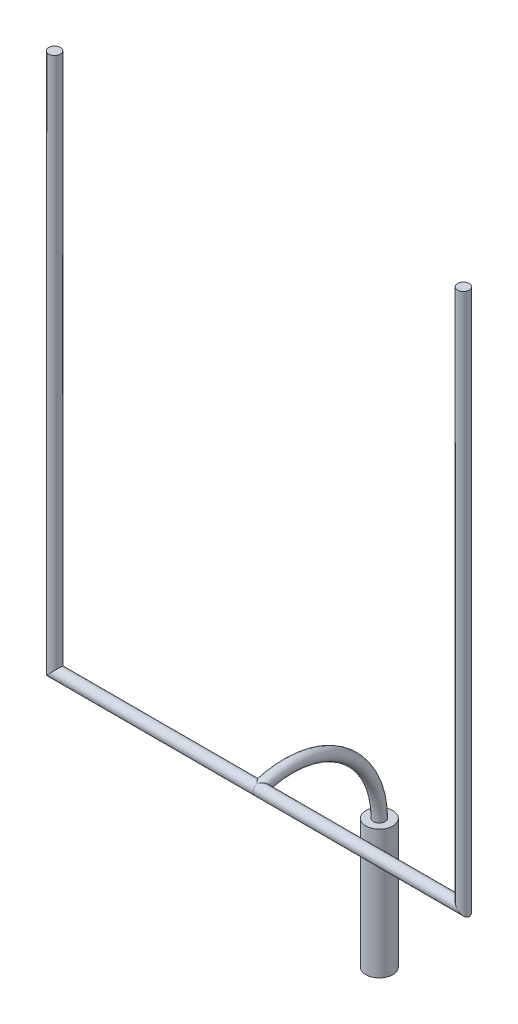
ISO-10303-21;
HEADER;
FILE_DESCRIPTION(('STEP AP214'),'2;1');
FILE_NAME('part.step','',(''),(''),'','','');
FILE_SCHEMA(('AUTOMOTIVE_DESIGN { 1 0 10303 214 1 1 1 1 }'));
ENDSEC;
DATA;
#1=APPLICATION_CONTEXT('core data for automotive mechanical design processes');
#2=APPLICATION_PROTOCOL_DEFINITION('international standard','automotive_design',2000,#1);
#3=PRODUCT_CONTEXT('',#1,'mechanical');
#4=PRODUCT('Part','Part','',(#3));
#5=PRODUCT_RELATED_PRODUCT_CATEGORY('part','',(#4));
#6=PRODUCT_DEFINITION_FORMATION('','',#4);
#7=PRODUCT_DEFINITION_CONTEXT('part definition',#1,'design');
#8=PRODUCT_DEFINITION('design','',#6,#7);
#9=PRODUCT_DEFINITION_SHAPE('','',#8);
#10=(LENGTH_UNIT() NAMED_UNIT(*) SI_UNIT(.MILLI.,.METRE.));
#11=(NAMED_UNIT(*) PLANE_ANGLE_UNIT() SI_UNIT($,.RADIAN.));
#12=(NAMED_UNIT(*) SI_UNIT($,.STERADIAN.) SOLID_ANGLE_UNIT());
#13=UNCERTAINTY_MEASURE_WITH_UNIT(LENGTH_MEASURE(1.E-05),#10,'distance_accuracy_value','');
#14=(GEOMETRIC_REPRESENTATION_CONTEXT(3) GLOBAL_UNCERTAINTY_ASSIGNED_CONTEXT((#13)) GLOBAL_UNIT_ASSIGNED_CONTEXT((#10,
#11,#12)) REPRESENTATION_CONTEXT('',''));
#15=CARTESIAN_POINT('',(0.,0.,0.));
#16=DIRECTION('',(0.,0.,1.));
#17=DIRECTION('',(1.,0.,0.));
#18=AXIS2_PLACEMENT_3D('',#15,#16,#17);
#19=CARTESIAN_POINT('',(3083.66,0.,0.));
#20=DIRECTION('',(-1.,0.,0.));
#21=DIRECTION('',(0.,0.,1.));
#22=AXIS2_PLACEMENT_3D('',#19,#20,#21);
#23=CYLINDRICAL_SURFACE('',#22,82.5499999999999);
#24=CARTESIAN_POINT('',(2901.95,0.,0.));
#25=DIRECTION('',(-0.707106781186548,-0.707106781186548,0.));
#26=DIRECTION('',(0.707106781186548,-0.707106781186548,0.));
#27=AXIS2_PLACEMENT_3D('',#24,#25,#26);
#28=ELLIPSE('',#27,116.743329573899,82.5499999999999);
#29=CARTESIAN_POINT('',(2984.5,-82.5499999999999,0.));
#30=VERTEX_POINT('',#29);
#31=EDGE_CURVE('E86',#30,#30,#28,.T.);
#32=ORIENTED_EDGE('',*,*,#31,.T.);
#33=EDGE_LOOP('',(#32));
#34=FACE_BOUND('',#33,.T.);
#35=CARTESIAN_POINT('',(-8.88178419700124E-13,78.0689842069123,26.8278997482261));
#36=CARTESIAN_POINT('',(0.0137526137191764,78.0735945406576,26.814483711531));
#37=CARTESIAN_POINT('',(0.0275052678156395,78.0782014298232,26.8010664470969));
#38=CARTESIAN_POINT('',(3.08016513766144,79.1000193873775,23.8225888660919));
#39=CARTESIAN_POINT('',(6.12098650557305,79.949020536648,20.7976454052892));
#40=CARTESIAN_POINT('',(10.6676792622444,80.9622208521222,16.1894772617866));
#41=CARTESIAN_POINT('',(12.1815995684165,81.2566555547236,14.640809709871));
#42=CARTESIAN_POINT('',(15.2023807463289,81.7571639559281,11.5222300338355));
#43=CARTESIAN_POINT('',(16.7092419740624,81.9632421588941,9.95231899690615));
#44=CARTESIAN_POINT('',(19.7166976476045,82.2856296700673,6.79038444290915));
#45=CARTESIAN_POINT('',(21.2172692539956,82.4017283075099,5.19831786300357));
#46=CARTESIAN_POINT('',(24.2059421156895,82.5413467696228,1.99834692675617));
#47=CARTESIAN_POINT('',(25.6940429736609,82.5648636556464,0.390442069313947));
#48=CARTESIAN_POINT('',(28.6540808544792,82.5170005232093,-2.83750558176604));
#49=CARTESIAN_POINT('',(30.1260249201922,82.4456636548796,-4.45754252307665));
#50=CARTESIAN_POINT('',(33.0510103771661,82.2055733571977,-7.70716669705318));
#51=CARTESIAN_POINT('',(34.5040531378198,82.0368270257751,-9.33675322530684));
#52=CARTESIAN_POINT('',(38.0725200117172,81.4950630871077,-13.3776311772001));
#53=CARTESIAN_POINT('',(40.1749505837302,81.0631033918399,-15.7927897465809));
#54=CARTESIAN_POINT('',(44.3182027787475,79.9703092987541,-20.6249256847988));
#55=CARTESIAN_POINT('',(46.3590245003999,79.3094752674308,-23.0419030507173));
#56=CARTESIAN_POINT('',(49.359684573773,78.1384448145418,-26.6549151948384));
#57=CARTESIAN_POINT('',(50.3490149094982,77.7185599964687,-27.856187287278));
#58=CARTESIAN_POINT('',(52.3059150180744,76.8171907197104,-30.2532934417663));
#59=CARTESIAN_POINT('',(53.2734844588815,76.3357053218262,-31.4491274206143));
#60=CARTESIAN_POINT('',(56.139334520776,74.7965268202431,-35.0244694298649));
#61=CARTESIAN_POINT('',(58.0017912952761,73.6437132148223,-37.3930615562089));
#62=CARTESIAN_POINT('',(61.1374639747837,71.4057848750984,-41.4684196952606));
#63=CARTESIAN_POINT('',(62.4381359322054,70.380780340228,-43.1873774034458));
#64=CARTESIAN_POINT('',(64.9618966707649,68.1790478828283,-46.5855806800507));
#65=CARTESIAN_POINT('',(66.1849895458207,67.002327976411,-48.2648283410676));
#66=CARTESIAN_POINT('',(67.9503718009989,65.1210404417728,-50.7427580728998));
#67=CARTESIAN_POINT('',(68.5271132461786,64.4748058772455,-51.5616511413792));
#68=CARTESIAN_POINT('',(69.6559197067674,63.1429689188051,-53.1842965422268));
#69=CARTESIAN_POINT('',(70.207986425722,62.4573692501523,-53.9880499176174));
#70=CARTESIAN_POINT('',(71.2853216334684,61.0466565966471,-55.578211311518));
#71=CARTESIAN_POINT('',(71.810597368598,60.321554407225,-56.3646239872644));
#72=CARTESIAN_POINT('',(72.8325245289523,58.8313479791324,-57.9183399795935));
#73=CARTESIAN_POINT('',(73.3291686514886,58.0662336291574,-58.6856383928614));
#74=CARTESIAN_POINT('',(74.574210429433,56.0348906182796,-60.64312224521));
#75=CARTESIAN_POINT('',(75.2991461725807,54.7382780944507,-61.8169920119358));
#76=CARTESIAN_POINT('',(76.6615844724329,52.0460809107292,-64.100086546178));
#77=CARTESIAN_POINT('',(77.2991066640121,50.6505185841884,-65.2093257987353));
#78=CARTESIAN_POINT('',(78.1825329974118,48.4859770421252,-66.8163208808241));
#79=CARTESIAN_POINT('',(78.4648591685488,47.752617015145,-67.3424955575715));
#80=CARTESIAN_POINT('',(79.0040864666705,46.2627590641157,-68.3745596005629));
#81=CARTESIAN_POINT('',(79.2609918076636,45.5062650023022,-68.8804523206465));
#82=CARTESIAN_POINT('',(79.7482630623224,43.9708084255491,-69.8706317501353));
#83=CARTESIAN_POINT('',(79.9786264300172,43.1918437641206,-70.3549163841144));
#84=CARTESIAN_POINT('',(80.4116787774177,41.612459583448,-71.3004404991716));
#85=CARTESIAN_POINT('',(80.6143665310881,40.812039115585,-71.7616789587258));
#86=CARTESIAN_POINT('',(80.9924465227119,39.1847146936264,-72.6631438057859));
#87=CARTESIAN_POINT('',(81.1676167896136,38.3576543768857,-73.1031812584879));
#88=CARTESIAN_POINT('',(81.4877768303132,36.6843759644941,-73.9570230193669));
#89=CARTESIAN_POINT('',(81.6327670719151,35.8381581660184,-74.3708277340939));
#90=CARTESIAN_POINT('',(81.891699917279,34.1281025816391,-75.170913452094));
#91=CARTESIAN_POINT('',(82.0056416654869,33.2642643109011,-75.5571936967022));
#92=CARTESIAN_POINT('',(82.2017364373064,31.5207392124337,-76.301007657329));
#93=CARTESIAN_POINT('',(82.2838894636278,30.6410523860554,-76.6585413757982));
#94=CARTESIAN_POINT('',(82.4157973471047,28.8681804606644,-77.3436053827107));
#95=CARTESIAN_POINT('',(82.465568403604,27.9750023399633,-77.6711506025647));
#96=CARTESIAN_POINT('',(82.532378628737,26.1767471834457,-78.2955061659696));
#97=CARTESIAN_POINT('',(82.5494175827858,25.2716700696611,-78.5923163080157));
#98=CARTESIAN_POINT('',(82.5505530059489,23.4518504237694,-79.1544064811792));
#99=CARTESIAN_POINT('',(82.5346525259788,22.5371087946163,-79.4196894300014));
#100=CARTESIAN_POINT('',(82.4699000603686,20.7000999002888,-79.9181710560628));
#101=CARTESIAN_POINT('',(82.421049022862,19.7778328524083,-80.1513706562496));
#102=CARTESIAN_POINT('',(82.2985010229947,18.0402728088317,-80.5589717155629));
#103=CARTESIAN_POINT('',(82.2285384627913,17.225579581009,-80.7370742718367));
#104=CARTESIAN_POINT('',(82.0635593717382,15.593543142641,-81.0681023562601));
#105=CARTESIAN_POINT('',(81.9685407509178,14.7761997166577,-81.2210257824444));
#106=CARTESIAN_POINT('',(81.753827242513,13.1405963098688,-81.5016293693087));
#107=CARTESIAN_POINT('',(81.6341372075463,12.3223365407288,-81.6293144844491));
#108=CARTESIAN_POINT('',(81.3705128036419,10.6861188359982,-81.8595872220261));
#109=CARTESIAN_POINT('',(81.2265761349324,9.86816093642214,-81.9621724614958));
#110=CARTESIAN_POINT('',(80.9150140698066,8.2340519821456,-82.1424279842582));
#111=CARTESIAN_POINT('',(80.7473898767075,7.41790083780038,-82.2200995325019));
#112=CARTESIAN_POINT('',(80.3890744950586,5.78867416778743,-82.3508467997098));
#113=CARTESIAN_POINT('',(80.1983812091078,4.9755989287165,-82.4039202801388));
#114=CARTESIAN_POINT('',(79.5927248557768,2.54298341275736,-82.5267868889319));
#115=CARTESIAN_POINT('',(79.1441240690958,0.929733902031384,-82.5602610404427));
#116=CARTESIAN_POINT('',(78.1512625314516,-2.3101934007913,-82.533972668692));
#117=CARTESIAN_POINT('',(77.6048872847617,-3.93619551866336,-82.4718539354532));
#118=CARTESIAN_POINT('',(76.4316512542737,-7.15246504501364,-82.2553496676798));
#119=CARTESIAN_POINT('',(75.8047917174958,-8.74273300670695,-82.1009655625657));
#120=CARTESIAN_POINT('',(74.4776851868844,-11.8817167849238,-81.7057561293019));
#121=CARTESIAN_POINT('',(73.7774181089259,-13.4304210833962,-81.4649071006275));
#122=CARTESIAN_POINT('',(72.3107539551687,-16.4812248386239,-80.9028958606558));
#123=CARTESIAN_POINT('',(71.544347590658,-17.9833177087858,-80.5817223563935));
#124=CARTESIAN_POINT('',(69.5197399246284,-21.7397862717107,-79.6704709470753));
#125=CARTESIAN_POINT('',(68.2204546522668,-23.9597957278733,-79.0290724789176));
#126=CARTESIAN_POINT('',(65.5031536077836,-28.273256074721,-77.590588812071));
#127=CARTESIAN_POINT('',(64.0850871689568,-30.3666522954922,-76.7934369808046));
#128=CARTESIAN_POINT('',(61.1469536087627,-34.427698151681,-75.0607765694565));
#129=CARTESIAN_POINT('',(59.6266678491083,-36.3950594614683,-74.1249659132629));
#130=CARTESIAN_POINT('',(56.5036887151607,-40.1986606709652,-72.1330664689261));
#131=CARTESIAN_POINT('',(54.9009962109263,-42.0349019545648,-71.0769789505354));
#132=CARTESIAN_POINT('',(52.1068295540965,-45.0587281961265,-69.1837933196446));
#133=CARTESIAN_POINT('',(50.9323371146702,-46.2788277858175,-68.3731038216855));
#134=CARTESIAN_POINT('',(48.5533322213771,-48.6550485997511,-66.70305660057));
#135=CARTESIAN_POINT('',(47.3488171704863,-49.8111642611871,-65.8436946588988));
#136=CARTESIAN_POINT('',(44.9132840518677,-52.0605238594211,-64.0800104909865));
#137=CARTESIAN_POINT('',(43.682255954664,-53.1537434083859,-63.1756710748739));
#138=CARTESIAN_POINT('',(41.1975653823786,-55.2777135752457,-61.3258515520013));
#139=CARTESIAN_POINT('',(39.9439035007109,-56.3084658278344,-60.3803725229286));
#140=CARTESIAN_POINT('',(37.4165902965392,-58.3087008847852,-58.4510841496884));
#141=CARTESIAN_POINT('',(36.1429332256321,-59.2781656515299,-57.4672636576287));
#142=CARTESIAN_POINT('',(33.5787086521829,-61.1563369307167,-55.4643111466179));
#143=CARTESIAN_POINT('',(32.2881408959554,-62.0650425304303,-54.4451785975556));
#144=CARTESIAN_POINT('',(29.6929600595624,-63.8221753972303,-52.3743812342396));
#145=CARTESIAN_POINT('',(28.388351133306,-64.6706199564213,-51.3227258778644));
#146=CARTESIAN_POINT('',(25.7670659558314,-66.3081077658808,-49.1888798413399));
#147=CARTESIAN_POINT('',(24.4503901527025,-67.0971532119197,-48.1066902919645));
#148=CARTESIAN_POINT('',(21.2298593971286,-68.9481195683215,-45.4349218562103));
#149=CARTESIAN_POINT('',(19.3206074141149,-69.9787842998693,-43.8300886758348));
#150=CARTESIAN_POINT('',(15.4871892693962,-71.9197241293383,-40.5667317949629));
#151=CARTESIAN_POINT('',(13.5630237472689,-72.8300043601236,-38.9082103873406));
#152=CARTESIAN_POINT('',(9.7081569776945,-74.5292964080167,-35.5447713297124));
#153=CARTESIAN_POINT('',(7.77747213379596,-75.3185093210985,-33.8399362774834));
#154=CARTESIAN_POINT('',(3.91152655052304,-76.777225707721,-30.3854277652865));
#155=CARTESIAN_POINT('',(1.97626689868053,-77.4467552014724,-28.6357641462422));
#156=CARTESIAN_POINT('',(0.0275326528241314,-78.0603245462791,-26.853089374189));
#157=CARTESIAN_POINT('',(0.013766318525671,-78.0646559026363,-26.8404950775537));
#158=CARTESIAN_POINT('',(-8.88178419700123E-13,-78.0689842069124,-26.8278997482262));
#159=B_SPLINE_CURVE_WITH_KNOTS('',3,(#35,#36,#37,#38,#39,#40,#41,#42,#43,#44,#45,#46,#47,#48,
#49,#50,#51,#52,#53,#54,#55,#56,#57,#58,#59,#60,#61,#62,#63,#64,#65,#66,#67,#68,#69,#70,#71,#72,
#73,#74,#75,#76,#77,#78,#79,#80,#81,#82,#83,#84,#85,#86,#87,#88,#89,#90,#91,#92,#93,#94,#95,#96,
#97,#98,#99,#100,#101,#102,#103,#104,#105,#106,#107,#108,#109,#110,#111,#112,#113,#114,#115,
#116,#117,#118,#119,#120,#121,#122,#123,#124,#125,#126,#127,#128,#129,#130,#131,#132,#133,#134,
#135,#136,#137,#138,#139,#140,#141,#142,#143,#144,#145,#146,#147,#148,#149,#150,#151,#152,#153,
#154,#155,#156,#157,#158),.UNSPECIFIED.,.F.,.F.,(4,2,2,2,2,2,2,2,2,2,2,2,2,2,2,2,2,2,2,2,2,2,2,
2,2,2,2,2,2,2,2,2,2,2,2,2,2,2,2,2,2,2,2,2,2,2,2,2,2,2,2,2,2,2,2,2,2,2,2,2,2,4),(0.,
0.0592742520203963,13.1569959796094,19.7126418499031,26.2679534774471,32.8385671922113,
39.4093894637947,45.9772236105296,52.5445792396744,62.2294327870123,71.9142708261411,
76.7486896499958,81.5831821910393,91.2471835022603,98.4025151654989,105.557468920744,
109.132619247306,112.707522362652,116.281453365639,119.856291927513,125.530780112442,
131.203991595658,134.040448594353,136.876434603345,139.712692420965,142.549075844662,
145.407278739026,148.265437326656,151.123674664067,153.981911757817,156.838717893548,
159.69554275785,162.552103029203,165.408581108177,167.918427325824,170.428482960468,
172.938045362841,175.447845929148,177.957519044341,180.467420506284,185.48624493192,
190.630771141595,195.775217651808,200.921075361924,206.067656944693,214.00862872283,
221.95300518226,229.914950560588,237.876811893131,243.507671724455,249.139020340015,
254.772537983383,260.405908140678,266.040928618681,271.67603372736,277.309515235793,
282.942788392416,291.035360570142,299.127587591536,307.206224175009,315.28310225121,
315.340565283618),.UNSPECIFIED.);
#160=CARTESIAN_POINT('',(0.,78.0689842069121,26.8278997482261));
#161=VERTEX_POINT('',#160);
#162=CARTESIAN_POINT('',(-8.85184662688255E-13,-78.0689842069122,-26.8278997482261));
#163=VERTEX_POINT('',#162);
#164=EDGE_CURVE('E100',#161,#163,#159,.T.);
#165=ORIENTED_EDGE('',*,*,#164,.F.);
#166=CARTESIAN_POINT('',(-8.88178419700125E-13,0.,0.));
#167=DIRECTION('',(1.,0.,0.));
#168=DIRECTION('',(0.,0.,-1.));
#169=AXIS2_PLACEMENT_3D('',#166,#167,#168);
#170=CIRCLE('',#169,82.5499999999999);
#171=EDGE_CURVE('E92',#161,#163,#170,.T.);
#172=ORIENTED_EDGE('',*,*,#171,.T.);
#173=EDGE_LOOP('',(#165,#172));
#174=FACE_BOUND('',#173,.T.);
#175=ADVANCED_FACE('F72',(#34,#174),#23,.T.);
#176=CARTESIAN_POINT('',(0.,0.,0.));
#177=DIRECTION('',(-1.,0.,0.));
#178=DIRECTION('',(0.,-1.,0.));
#179=AXIS2_PLACEMENT_3D('',#176,#177,#178);
#180=CYLINDRICAL_SURFACE('',#179,82.5499999999999);
#181=CARTESIAN_POINT('',(-2901.95,-3.55386377878566E-13,0.));
#182=DIRECTION('',(-0.707106781186548,0.707106781186547,0.));
#183=DIRECTION('',(-0.707106781186547,-0.707106781186548,0.));
#184=AXIS2_PLACEMENT_3D('',#181,#182,#183);
#185=ELLIPSE('',#184,116.743329573899,82.5499999999999);
#186=CARTESIAN_POINT('',(-2984.5,-82.5500000000003,0.));
#187=VERTEX_POINT('',#186);
#188=EDGE_CURVE('E98',#187,#187,#185,.T.);
#189=ORIENTED_EDGE('',*,*,#188,.F.);
#190=EDGE_LOOP('',(#189));
#191=FACE_BOUND('',#190,.T.);
#192=CARTESIAN_POINT('',(0.,78.0689842069123,26.8278997482261));
#193=CARTESIAN_POINT('',(-0.0137526137200742,78.0735945406576,26.814483711531));
#194=CARTESIAN_POINT('',(-0.0275052678165372,78.0782014298232,26.8010664470969));
#195=CARTESIAN_POINT('',(-3.08016513766223,79.1000193873785,23.8225888660923));
#196=CARTESIAN_POINT('',(-6.12098650557369,79.9490205366481,20.7976454052893));
#197=CARTESIAN_POINT('',(-10.6676792622448,80.9622208521221,16.1894772617865));
#198=CARTESIAN_POINT('',(-12.1815995684168,81.2566555547236,14.6408097098709));
#199=CARTESIAN_POINT('',(-15.202380746329,81.7571639559282,11.5222300338352));
#200=CARTESIAN_POINT('',(-16.7092419740623,81.9632421588941,9.95231899690572));
#201=CARTESIAN_POINT('',(-19.7166976476045,82.2856296700673,6.79038444290867));
#202=CARTESIAN_POINT('',(-21.2172692539957,82.40172830751,5.19831786300318));
#203=CARTESIAN_POINT('',(-24.2059421156898,82.5413467696228,1.99834692675592));
#204=CARTESIAN_POINT('',(-25.6940429736614,82.5648636556464,0.390442069313757));
#205=CARTESIAN_POINT('',(-28.6540808544797,82.5170005232093,-2.83750558176619));
#206=CARTESIAN_POINT('',(-30.1260249201927,82.4456636548796,-4.45754252307681));
#207=CARTESIAN_POINT('',(-33.0510103771666,82.2055733571976,-7.70716669705339));
#208=CARTESIAN_POINT('',(-34.5040531378203,82.0368270257751,-9.33675322530708));
#209=CARTESIAN_POINT('',(-38.0725200117177,81.4950630871076,-13.3776311772004));
#210=CARTESIAN_POINT('',(-40.1749505837306,81.0631033918399,-15.7927897465812));
#211=CARTESIAN_POINT('',(-44.3182027787478,79.970309298754,-20.6249256847992));
#212=CARTESIAN_POINT('',(-46.3590245004001,79.3094752674306,-23.0419030507178));
#213=CARTESIAN_POINT('',(-49.3596845737734,78.1384448145416,-26.6549151948388));
#214=CARTESIAN_POINT('',(-50.3490149094987,77.7185599964686,-27.8561872872783));
#215=CARTESIAN_POINT('',(-52.3059150180749,76.8171907197102,-30.2532934417665));
#216=CARTESIAN_POINT('',(-53.2734844588818,76.3357053218261,-31.4491274206146));
#217=CARTESIAN_POINT('',(-56.1393345207761,74.7965268202429,-35.0244694298653));
#218=CARTESIAN_POINT('',(-58.0017912952763,73.6437132148221,-37.3930615562092));
#219=CARTESIAN_POINT('',(-61.137463974784,71.4057848750983,-41.4684196952608));
#220=CARTESIAN_POINT('',(-62.4381359322057,70.3807803402278,-43.187377403446));
#221=CARTESIAN_POINT('',(-64.961896670765,68.1790478828281,-46.585580680051));
#222=CARTESIAN_POINT('',(-66.1849895458208,67.0023279764108,-48.2648283410678));
#223=CARTESIAN_POINT('',(-67.9503718009991,65.1210404417726,-50.7427580729));
#224=CARTESIAN_POINT('',(-68.5271132461789,64.4748058772454,-51.5616511413794));
#225=CARTESIAN_POINT('',(-69.6559197067677,63.1429689188049,-53.184296542227));
#226=CARTESIAN_POINT('',(-70.2079864257222,62.4573692501521,-53.9880499176176));
#227=CARTESIAN_POINT('',(-71.2853216334686,61.0466565966469,-55.5782113115183));
#228=CARTESIAN_POINT('',(-71.8105973685983,60.3215544072248,-56.3646239872647));
#229=CARTESIAN_POINT('',(-72.8325245289525,58.8313479791322,-57.9183399795937));
#230=CARTESIAN_POINT('',(-73.3291686514888,58.0662336291571,-58.6856383928617));
#231=CARTESIAN_POINT('',(-74.574210429433,56.0348906182793,-60.6431222452103));
#232=CARTESIAN_POINT('',(-75.2991461725808,54.7382780944504,-61.8169920119361));
#233=CARTESIAN_POINT('',(-76.661584472433,52.0460809107289,-64.1000865461783));
#234=CARTESIAN_POINT('',(-77.2991066640122,50.650518584188,-65.2093257987356));
#235=CARTESIAN_POINT('',(-78.1825329974119,48.4859770421249,-66.8163208808243));
#236=CARTESIAN_POINT('',(-78.4648591685489,47.7526170151447,-67.3424955575717));
#237=CARTESIAN_POINT('',(-79.0040864666705,46.2627590641153,-68.3745596005631));
#238=CARTESIAN_POINT('',(-79.2609918076637,45.5062650023019,-68.8804523206467));
#239=CARTESIAN_POINT('',(-79.7482630623225,43.9708084255488,-69.8706317501355));
#240=CARTESIAN_POINT('',(-79.9786264300172,43.1918437641203,-70.3549163841146));
#241=CARTESIAN_POINT('',(-80.4116787774178,41.6124595834477,-71.3004404991718));
#242=CARTESIAN_POINT('',(-80.6143665310882,40.8120391155847,-71.761678958726));
#243=CARTESIAN_POINT('',(-80.9924465227119,39.1847146936261,-72.6631438057861));
#244=CARTESIAN_POINT('',(-81.1676167896137,38.3576543768854,-73.1031812584881));
#245=CARTESIAN_POINT('',(-81.4877768303133,36.6843759644939,-73.957023019367));
#246=CARTESIAN_POINT('',(-81.6327670719151,35.8381581660181,-74.3708277340941));
#247=CARTESIAN_POINT('',(-81.891699917279,34.1281025816388,-75.1709134520941));
#248=CARTESIAN_POINT('',(-82.0056416654869,33.2642643109008,-75.5571936967023));
#249=CARTESIAN_POINT('',(-82.2017364373064,31.5207392124335,-76.3010076573291));
#250=CARTESIAN_POINT('',(-82.2838894636278,30.6410523860552,-76.6585413757982));
#251=CARTESIAN_POINT('',(-82.4157973471047,28.8681804606642,-77.3436053827108));
#252=CARTESIAN_POINT('',(-82.465568403604,27.9750023399631,-77.6711506025647));
#253=CARTESIAN_POINT('',(-82.532378628737,26.1767471834455,-78.2955061659697));
#254=CARTESIAN_POINT('',(-82.5494175827858,25.2716700696608,-78.5923163080158));
#255=CARTESIAN_POINT('',(-82.5505530059489,23.4518504237691,-79.1544064811793));
#256=CARTESIAN_POINT('',(-82.5346525259788,22.537108794616,-79.4196894300015));
#257=CARTESIAN_POINT('',(-82.4699000603686,20.7000999002885,-79.9181710560629));
#258=CARTESIAN_POINT('',(-82.421049022862,19.777832852408,-80.1513706562497));
#259=CARTESIAN_POINT('',(-82.2985010229946,18.0402728088314,-80.558971715563));
#260=CARTESIAN_POINT('',(-82.2285384627913,17.2255795810087,-80.7370742718367));
#261=CARTESIAN_POINT('',(-82.0635593717381,15.5935431426406,-81.0681023562602));
#262=CARTESIAN_POINT('',(-81.9685407509177,14.7761997166573,-81.2210257824445));
#263=CARTESIAN_POINT('',(-81.7538272425129,13.1405963098683,-81.5016293693088));
#264=CARTESIAN_POINT('',(-81.6341372075461,12.3223365407282,-81.6293144844492));
#265=CARTESIAN_POINT('',(-81.3705128036417,10.6861188359976,-81.8595872220261));
#266=CARTESIAN_POINT('',(-81.2265761349323,9.86816093642148,-81.9621724614959));
#267=CARTESIAN_POINT('',(-80.9150140698065,8.23405198214491,-82.1424279842583));
#268=CARTESIAN_POINT('',(-80.7473898767074,7.41790083779971,-82.220099532502));
#269=CARTESIAN_POINT('',(-80.3890744950585,5.7886741677868,-82.3508467997098));
#270=CARTESIAN_POINT('',(-80.1983812091077,4.97559892871589,-82.4039202801388));
#271=CARTESIAN_POINT('',(-79.5927248557766,2.54298341275681,-82.5267868889319));
#272=CARTESIAN_POINT('',(-79.1441240690957,0.929733902030885,-82.5602610404428));
#273=CARTESIAN_POINT('',(-78.1512625314515,-2.31019340079157,-82.533972668692));
#274=CARTESIAN_POINT('',(-77.6048872847617,-3.93619551866345,-82.4718539354532));
#275=CARTESIAN_POINT('',(-76.4316512542737,-7.15246504501338,-82.2553496676798));
#276=CARTESIAN_POINT('',(-75.8047917174959,-8.74273300670651,-82.1009655625657));
#277=CARTESIAN_POINT('',(-74.4776851868845,-11.8817167849234,-81.7057561293019));
#278=CARTESIAN_POINT('',(-73.7774181089259,-13.4304210833961,-81.4649071006275));
#279=CARTESIAN_POINT('',(-72.3107539551686,-16.4812248386241,-80.9028958606558));
#280=CARTESIAN_POINT('',(-71.5443475906578,-17.9833177087862,-80.5817223563934));
#281=CARTESIAN_POINT('',(-69.5197399246277,-21.7397862717121,-79.6704709470749));
#282=CARTESIAN_POINT('',(-68.2204546522655,-23.9597957278754,-79.029072478917));
#283=CARTESIAN_POINT('',(-65.5031536077812,-28.2732560747247,-77.5905888120697));
#284=CARTESIAN_POINT('',(-64.0850871689538,-30.3666522954965,-76.793436980803));
#285=CARTESIAN_POINT('',(-61.1469536087594,-34.4276981516852,-75.0607765694546));
#286=CARTESIAN_POINT('',(-59.6266678491056,-36.3950594614718,-74.1249659132611));
#287=CARTESIAN_POINT('',(-56.5036887151589,-40.1986606709672,-72.1330664689249));
#288=CARTESIAN_POINT('',(-54.9009962109249,-42.034901954566,-71.0769789505347));
#289=CARTESIAN_POINT('',(-52.1068295540964,-45.0587281961263,-69.1837933196447));
#290=CARTESIAN_POINT('',(-50.932337114671,-46.2788277858167,-68.3731038216861));
#291=CARTESIAN_POINT('',(-48.5533322213795,-48.6550485997488,-66.7030566005716));
#292=CARTESIAN_POINT('',(-47.3488171704895,-49.8111642611842,-65.8436946589011));
#293=CARTESIAN_POINT('',(-44.9132840518723,-52.060523859417,-64.0800104909898));
#294=CARTESIAN_POINT('',(-43.6822559546693,-53.1537434083814,-63.1756710748777));
#295=CARTESIAN_POINT('',(-41.1975653823852,-55.2777135752403,-61.3258515520061));
#296=CARTESIAN_POINT('',(-39.9439035007183,-56.3084658278285,-60.380372522934));
#297=CARTESIAN_POINT('',(-37.4165902965463,-58.3087008847797,-58.4510841496939));
#298=CARTESIAN_POINT('',(-36.1429332256381,-59.2781656515251,-57.4672636576337));
#299=CARTESIAN_POINT('',(-33.5787086521874,-61.1563369307135,-55.4643111466214));
#300=CARTESIAN_POINT('',(-32.2881408959595,-62.065042530428,-54.4451785975579));
#301=CARTESIAN_POINT('',(-29.6929600595641,-63.8221753972288,-52.3743812342416));
#302=CARTESIAN_POINT('',(-28.3883511333056,-64.6706199564198,-51.3227258778672));
#303=CARTESIAN_POINT('',(-25.767065955833,-66.3081077658812,-49.1888798413386));
#304=CARTESIAN_POINT('',(-24.450390152708,-67.097153211922,-48.1066902919582));
#305=CARTESIAN_POINT('',(-21.2298593971186,-68.9481195683192,-45.4349218562181));
#306=CARTESIAN_POINT('',(-19.3206074140742,-69.9787842998565,-43.8300886758725));
#307=CARTESIAN_POINT('',(-15.4871892694341,-71.9197241293523,-40.5667317949231));
#308=CARTESIAN_POINT('',(-13.5630237474162,-72.8300043601747,-38.9082103871931));
#309=CARTESIAN_POINT('',(-9.7081569775433,-74.5292964079673,-35.5447713298566));
#310=CARTESIAN_POINT('',(-7.77747213323782,-75.3185093209117,-33.8399362780262));
#311=CARTESIAN_POINT('',(-3.91152655107638,-76.7772257079073,-30.3854277647449));
#312=CARTESIAN_POINT('',(-1.97626690075189,-77.4467552021689,-28.6357641442181));
#313=CARTESIAN_POINT('',(-0.0275326528546698,-78.0603245462889,-26.8530893741605));
#314=CARTESIAN_POINT('',(-0.01376631854147,-78.0646559026413,-26.8404950775394));
#315=CARTESIAN_POINT('',(0.,-78.0689842069124,-26.8278997482262));
#316=B_SPLINE_CURVE_WITH_KNOTS('',3,(#192,#193,#194,#195,#196,#197,#198,#199,#200,#201,#202,
#203,#204,#205,#206,#207,#208,#209,#210,#211,#212,#213,#214,#215,#216,#217,#218,#219,#220,#221,
#222,#223,#224,#225,#226,#227,#228,#229,#230,#231,#232,#233,#234,#235,#236,#237,#238,#239,#240,
#241,#242,#243,#244,#245,#246,#247,#248,#249,#250,#251,#252,#253,#254,#255,#256,#257,#258,#259,
#260,#261,#262,#263,#264,#265,#266,#267,#268,#269,#270,#271,#272,#273,#274,#275,#276,#277,#278,
#279,#280,#281,#282,#283,#284,#285,#286,#287,#288,#289,#290,#291,#292,#293,#294,#295,#296,#297,
#298,#299,#300,#301,#302,#303,#304,#305,#306,#307,#308,#309,#310,#311,#312,#313,#314,#315),
.UNSPECIFIED.,.F.,.F.,(4,2,2,2,2,2,2,2,2,2,2,2,2,2,2,2,2,2,2,2,2,2,2,2,2,2,2,2,2,2,2,2,2,2,2,2,
2,2,2,2,2,2,2,2,2,2,2,2,2,2,2,2,2,2,2,2,2,2,2,2,2,4),(0.,0.0592742520203972,13.1569959796091,
19.7126418499028,26.2679534774468,32.838567192211,39.4093894637946,45.9772236105295,
52.5445792396743,62.2294327870122,71.9142708261411,76.7486896499957,81.5831821910392,
91.2471835022601,98.4025151654986,105.557468920744,109.132619247305,112.707522362651,
116.281453365639,119.856291927513,125.530780112442,131.203991595658,134.040448594353,
136.876434603345,139.712692420965,142.549075844662,145.407278739025,148.265437326655,
151.123674664067,153.981911757817,156.838717893548,159.695542757849,162.552103029202,
165.408581108176,167.918427325824,170.428482960468,172.938045362841,175.447845929149,
177.957519044341,180.467420506284,185.48624493192,190.630771141595,195.775217651806,
200.921075361924,206.067656944693,214.008628722833,221.953005182266,229.914950560591,
237.876811893131,243.507671724452,249.139020340008,254.772537983373,260.405908140665,
266.040928618673,271.676033727356,277.309515235791,282.942788392417,291.035360570142,
299.127587591538,307.20622417501,315.283102251209,315.340565283617),.UNSPECIFIED.);
#317=EDGE_CURVE('E14',#163,#161,#316,.F.);
#318=ORIENTED_EDGE('',*,*,#317,.F.);
#319=ORIENTED_EDGE('',*,*,#171,.F.);
#320=EDGE_LOOP('',(#318,#319));
#321=FACE_BOUND('',#320,.T.);
#322=ADVANCED_FACE('F94',(#191,#321),#180,.T.);
#323=CARTESIAN_POINT('',(-2901.95,7620.,0.));
#324=DIRECTION('',(0.,-1.,0.));
#325=DIRECTION('',(0.,0.,-1.));
#326=AXIS2_PLACEMENT_3D('',#323,#324,#325);
#327=PLANE('',#326);
#328=CARTESIAN_POINT('',(-2901.95,7620.,0.));
#329=DIRECTION('',(0.,-1.,0.));
#330=DIRECTION('',(0.,0.,-1.));
#331=AXIS2_PLACEMENT_3D('',#328,#329,#330);
#332=CIRCLE('',#331,82.5499999999999);
#333=CARTESIAN_POINT('',(-2901.95,7620.,-82.5499999999999));
#334=VERTEX_POINT('',#333);
#335=EDGE_CURVE('E102',#334,#334,#332,.T.);
#336=ORIENTED_EDGE('',*,*,#335,.F.);
#337=EDGE_LOOP('',(#336));
#338=FACE_BOUND('',#337,.T.);
#339=ADVANCED_FACE('F74',(#338),#327,.F.);
#340=CARTESIAN_POINT('',(2901.95,7620.,0.));
#341=DIRECTION('',(0.,1.,0.));
#342=DIRECTION('',(0.,0.,-1.));
#343=AXIS2_PLACEMENT_3D('',#340,#341,#342);
#344=PLANE('',#343);
#345=CARTESIAN_POINT('',(2901.95,7620.,0.));
#346=DIRECTION('',(0.,1.,0.));
#347=DIRECTION('',(0.,0.,-1.));
#348=AXIS2_PLACEMENT_3D('',#345,#346,#347);
#349=CIRCLE('',#348,82.5499999999999);
#350=CARTESIAN_POINT('',(2901.95,7620.,-82.5499999999999));
#351=VERTEX_POINT('',#350);
#352=EDGE_CURVE('E97',#351,#351,#349,.T.);
#353=ORIENTED_EDGE('',*,*,#352,.T.);
#354=EDGE_LOOP('',(#353));
#355=FACE_BOUND('',#354,.T.);
#356=ADVANCED_FACE('F124',(#355),#344,.T.);
#357=CARTESIAN_POINT('',(-2901.95,-181.710000000001,0.));
#358=DIRECTION('',(0.,1.,0.));
#359=DIRECTION('',(0.,0.,1.));
#360=AXIS2_PLACEMENT_3D('',#357,#358,#359);
#361=CYLINDRICAL_SURFACE('',#360,82.5499999999999);
#362=ORIENTED_EDGE('',*,*,#188,.T.);
#363=EDGE_LOOP('',(#362));
#364=FACE_BOUND('',#363,.T.);
#365=ORIENTED_EDGE('',*,*,#335,.T.);
#366=EDGE_LOOP('',(#365));
#367=FACE_BOUND('',#366,.T.);
#368=ADVANCED_FACE('F117',(#364,#367),#361,.T.);
#369=CARTESIAN_POINT('',(2901.95,7620.,0.));
#370=DIRECTION('',(0.,-1.,0.));
#371=DIRECTION('',(0.,0.,-1.));
#372=AXIS2_PLACEMENT_3D('',#369,#370,#371);
#373=CYLINDRICAL_SURFACE('',#372,82.5499999999999);
#374=ORIENTED_EDGE('',*,*,#352,.F.);
#375=EDGE_LOOP('',(#374));
#376=FACE_BOUND('',#375,.T.);
#377=ORIENTED_EDGE('',*,*,#31,.F.);
#378=EDGE_LOOP('',(#377));
#379=FACE_BOUND('',#378,.T.);
#380=ADVANCED_FACE('F108',(#376,#379),#373,.T.);
#381=CARTESIAN_POINT('',(0.,-1219.2,-418.970167286246));
#382=DIRECTION('',(1.,0.,0.));
#383=DIRECTION('',(0.,0.,-1.));
#384=AXIS2_PLACEMENT_3D('',#381,#382,#383);
#385=TOROIDAL_SURFACE('',#384,1289.17983271375,82.55);
#386=CARTESIAN_POINT('',(0.,-1219.2,-1708.15));
#387=DIRECTION('',(0.,-1.,0.));
#388=DIRECTION('',(0.,0.,-1.));
#389=AXIS2_PLACEMENT_3D('',#386,#387,#388);
#390=CIRCLE('',#389,82.55);
#391=CARTESIAN_POINT('',(0.,-1219.2,-1790.7));
#392=VERTEX_POINT('',#391);
#393=EDGE_CURVE('E103',#392,#392,#390,.T.);
#394=ORIENTED_EDGE('',*,*,#393,.F.);
#395=EDGE_LOOP('',(#394));
#396=FACE_BOUND('',#395,.T.);
#397=ORIENTED_EDGE('',*,*,#317,.T.);
#398=ORIENTED_EDGE('',*,*,#164,.T.);
#399=EDGE_LOOP('',(#397,#398));
#400=FACE_BOUND('',#399,.T.);
#401=ADVANCED_FACE('F105',(#396,#400),#385,.T.);
#402=CARTESIAN_POINT('',(0.,-1219.2,-1708.15));
#403=DIRECTION('',(0.,-1.,0.));
#404=DIRECTION('',(0.,0.,-1.));
#405=AXIS2_PLACEMENT_3D('',#402,#403,#404);
#406=CYLINDRICAL_SURFACE('',#405,190.5);
#407=CARTESIAN_POINT('',(0.,-1219.2,-1708.15));
#408=DIRECTION('',(0.,-1.,0.));
#409=DIRECTION('',(0.,0.,-1.));
#410=AXIS2_PLACEMENT_3D('',#407,#408,#409);
#411=CIRCLE('',#410,190.5);
#412=CARTESIAN_POINT('',(0.,-1219.2,-1898.65));
#413=VERTEX_POINT('',#412);
#414=EDGE_CURVE('E214',#413,#413,#411,.T.);
#415=ORIENTED_EDGE('',*,*,#414,.T.);
#416=EDGE_LOOP('',(#415));
#417=FACE_BOUND('',#416,.T.);
#418=CARTESIAN_POINT('',(0.,-3048.,-1708.15));
#419=DIRECTION('',(0.,-1.,0.));
#420=DIRECTION('',(0.,0.,-1.));
#421=AXIS2_PLACEMENT_3D('',#418,#419,#420);
#422=CIRCLE('',#421,190.5);
#423=CARTESIAN_POINT('',(0.,-3048.,-1898.65));
#424=VERTEX_POINT('',#423);
#425=EDGE_CURVE('E212',#424,#424,#422,.T.);
#426=ORIENTED_EDGE('',*,*,#425,.F.);
#427=EDGE_LOOP('',(#426));
#428=FACE_BOUND('',#427,.T.);
#429=ADVANCED_FACE('F107',(#417,#428),#406,.T.);
#430=CARTESIAN_POINT('',(0.,-1219.2,-1708.15));
#431=DIRECTION('',(0.,-1.,0.));
#432=DIRECTION('',(0.,0.,-1.));
#433=AXIS2_PLACEMENT_3D('',#430,#431,#432);
#434=PLANE('',#433);
#435=ORIENTED_EDGE('',*,*,#393,.T.);
#436=EDGE_LOOP('',(#435));
#437=FACE_BOUND('',#436,.T.);
#438=ORIENTED_EDGE('',*,*,#414,.F.);
#439=EDGE_LOOP('',(#438));
#440=FACE_BOUND('',#439,.T.);
#441=ADVANCED_FACE('F114',(#437,#440),#434,.F.);
#442=CARTESIAN_POINT('',(0.,-3048.,-1708.15));
#443=DIRECTION('',(0.,-1.,0.));
#444=DIRECTION('',(0.,0.,-1.));
#445=AXIS2_PLACEMENT_3D('',#442,#443,#444);
#446=PLANE('',#445);
#447=ORIENTED_EDGE('',*,*,#425,.T.);
#448=EDGE_LOOP('',(#447));
#449=FACE_BOUND('',#448,.T.);
#450=ADVANCED_FACE('F195',(#449),#446,.T.);
#451=CLOSED_SHELL('',(#175,#322,#339,#356,#368,#380,#401,#429,#441,#450));
#452=MANIFOLD_SOLID_BREP('B2',#451);
#453=ADVANCED_BREP_SHAPE_REPRESENTATION('',(#18,#452),#14);
#454=SHAPE_DEFINITION_REPRESENTATION(#9,#453);
ENDSEC;
END-ISO-10303-21;
